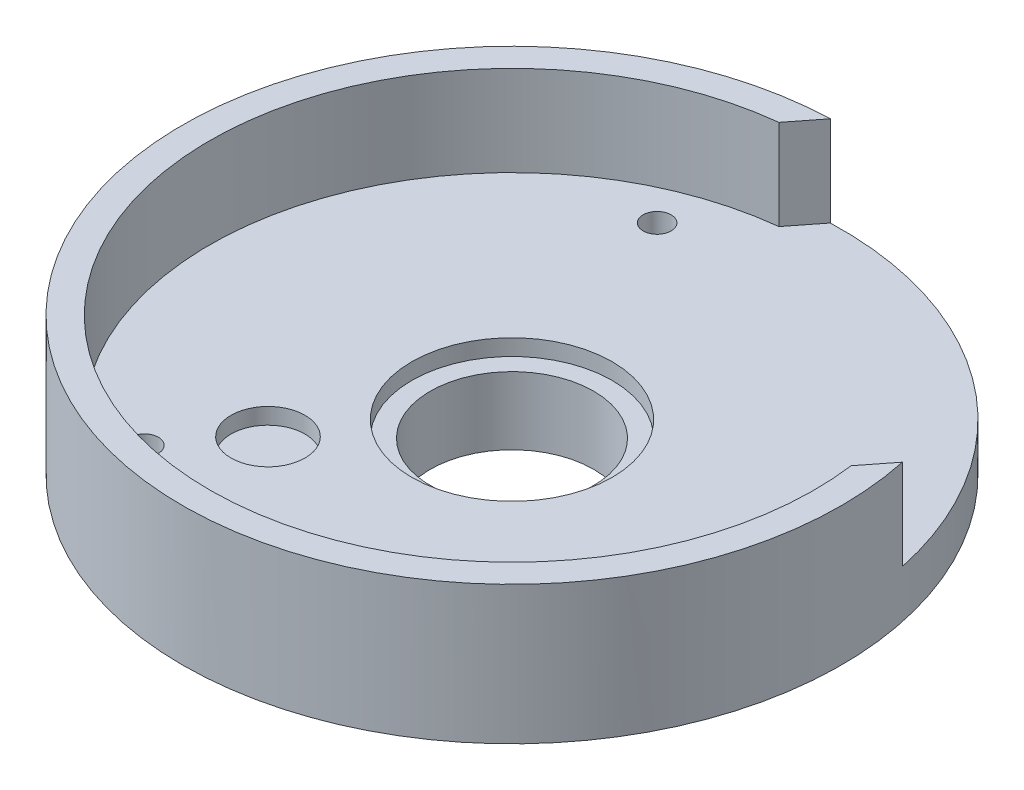
ISO-10303-21;
HEADER;
FILE_DESCRIPTION(('STEP AP214'),'2;1');
FILE_NAME('part.step','',(''),(''),'','','');
FILE_SCHEMA(('AUTOMOTIVE_DESIGN { 1 0 10303 214 1 1 1 1 }'));
ENDSEC;
DATA;
#1=APPLICATION_CONTEXT('core data for automotive mechanical design processes');
#2=APPLICATION_PROTOCOL_DEFINITION('international standard','automotive_design',2000,#1);
#3=PRODUCT_CONTEXT('',#1,'mechanical');
#4=PRODUCT('Part','Part','',(#3));
#5=PRODUCT_RELATED_PRODUCT_CATEGORY('part','',(#4));
#6=PRODUCT_DEFINITION_FORMATION('','',#4);
#7=PRODUCT_DEFINITION_CONTEXT('part definition',#1,'design');
#8=PRODUCT_DEFINITION('design','',#6,#7);
#9=PRODUCT_DEFINITION_SHAPE('','',#8);
#10=(LENGTH_UNIT() NAMED_UNIT(*) SI_UNIT(.MILLI.,.METRE.));
#11=(NAMED_UNIT(*) PLANE_ANGLE_UNIT() SI_UNIT($,.RADIAN.));
#12=(NAMED_UNIT(*) SI_UNIT($,.STERADIAN.) SOLID_ANGLE_UNIT());
#13=UNCERTAINTY_MEASURE_WITH_UNIT(LENGTH_MEASURE(1.E-05),#10,'distance_accuracy_value','');
#14=(GEOMETRIC_REPRESENTATION_CONTEXT(3) GLOBAL_UNCERTAINTY_ASSIGNED_CONTEXT((#13)) GLOBAL_UNIT_ASSIGNED_CONTEXT((#10,
#11,#12)) REPRESENTATION_CONTEXT('',''));
#15=CARTESIAN_POINT('',(0.,0.,0.));
#16=DIRECTION('',(0.,0.,1.));
#17=DIRECTION('',(1.,0.,0.));
#18=AXIS2_PLACEMENT_3D('',#15,#16,#17);
#19=CARTESIAN_POINT('',(0.,5.3,0.));
#20=DIRECTION('',(0.,-1.,0.));
#21=DIRECTION('',(0.,0.,-1.));
#22=AXIS2_PLACEMENT_3D('',#19,#20,#21);
#23=CYLINDRICAL_SURFACE('',#22,11.1);
#24=CARTESIAN_POINT('',(0.,5.3,0.));
#25=DIRECTION('',(0.,1.,0.));
#26=DIRECTION('',(0.,0.,1.));
#27=AXIS2_PLACEMENT_3D('',#24,#25,#26);
#28=CIRCLE('',#27,11.1);
#29=CARTESIAN_POINT('',(0.,5.3,11.1));
#30=VERTEX_POINT('',#29);
#31=EDGE_CURVE('E262',#30,#30,#28,.T.);
#32=ORIENTED_EDGE('',*,*,#31,.T.);
#33=EDGE_LOOP('',(#32));
#34=FACE_BOUND('',#33,.T.);
#35=CARTESIAN_POINT('',(0.,3.5,0.));
#36=DIRECTION('',(0.,-1.,0.));
#37=DIRECTION('',(0.,0.,-1.));
#38=AXIS2_PLACEMENT_3D('',#35,#36,#37);
#39=CIRCLE('',#38,11.1);
#40=CARTESIAN_POINT('',(0.,3.5,-11.1));
#41=VERTEX_POINT('',#40);
#42=EDGE_CURVE('E279',#41,#41,#39,.T.);
#43=ORIENTED_EDGE('',*,*,#42,.T.);
#44=EDGE_LOOP('',(#43));
#45=FACE_BOUND('',#44,.T.);
#46=ADVANCED_FACE('F181',(#34,#45),#23,.F.);
#47=CARTESIAN_POINT('',(0.,5.3,0.));
#48=DIRECTION('',(0.,-1.,0.));
#49=DIRECTION('',(0.,0.,-1.));
#50=AXIS2_PLACEMENT_3D('',#47,#48,#49);
#51=CYLINDRICAL_SURFACE('',#50,36.5);
#52=CARTESIAN_POINT('',(0.,0.,0.));
#53=DIRECTION('',(0.,1.,0.));
#54=DIRECTION('',(0.,0.,1.));
#55=AXIS2_PLACEMENT_3D('',#52,#53,#54);
#56=CIRCLE('',#55,36.5);
#57=CARTESIAN_POINT('',(0.,0.,36.5));
#58=VERTEX_POINT('',#57);
#59=EDGE_CURVE('E251',#58,#58,#56,.T.);
#60=ORIENTED_EDGE('',*,*,#59,.T.);
#61=EDGE_LOOP('',(#60));
#62=FACE_BOUND('',#61,.T.);
#63=DIRECTION('',(0.,-1.,0.));
#64=VECTOR('',#63,1.);
#65=CARTESIAN_POINT('',(35.7128915684139,5.3,-7.53918933458428));
#66=LINE('',#65,#64);
#67=CARTESIAN_POINT('',(35.7128915684139,15.3,-7.53918933458428));
#68=VERTEX_POINT('',#67);
#69=CARTESIAN_POINT('',(35.7128915684139,5.3,-7.53918933458428));
#70=VERTEX_POINT('',#69);
#71=EDGE_CURVE('E254',#68,#70,#66,.T.);
#72=ORIENTED_EDGE('',*,*,#71,.F.);
#73=CARTESIAN_POINT('',(0.,15.3,0.));
#74=DIRECTION('',(0.,1.,0.));
#75=DIRECTION('',(0.,0.,1.));
#76=AXIS2_PLACEMENT_3D('',#73,#74,#75);
#77=CIRCLE('',#76,36.5);
#78=CARTESIAN_POINT('',(-1.22317356805291,15.3,-36.4794989880949));
#79=VERTEX_POINT('',#78);
#80=EDGE_CURVE('E241',#79,#68,#77,.T.);
#81=ORIENTED_EDGE('',*,*,#80,.F.);
#82=DIRECTION('',(0.,-1.,0.));
#83=VECTOR('',#82,1.);
#84=CARTESIAN_POINT('',(-1.22317356805292,5.3,-36.4794989880949));
#85=LINE('',#84,#83);
#86=CARTESIAN_POINT('',(-1.22317356805291,5.3,-36.4794989880949));
#87=VERTEX_POINT('',#86);
#88=EDGE_CURVE('E233',#87,#79,#85,.F.);
#89=ORIENTED_EDGE('',*,*,#88,.F.);
#90=CARTESIAN_POINT('',(0.,5.3,0.));
#91=DIRECTION('',(0.,1.,0.));
#92=DIRECTION('',(0.,0.,1.));
#93=AXIS2_PLACEMENT_3D('',#90,#91,#92);
#94=CIRCLE('',#93,36.5);
#95=EDGE_CURVE('E325',#70,#87,#94,.T.);
#96=ORIENTED_EDGE('',*,*,#95,.F.);
#97=EDGE_LOOP('',(#72,#81,#89,#96));
#98=FACE_BOUND('',#97,.T.);
#99=ADVANCED_FACE('F335',(#62,#98),#51,.T.);
#100=CARTESIAN_POINT('',(0.,15.3,0.));
#101=DIRECTION('',(0.,1.,0.));
#102=DIRECTION('',(0.,0.,1.));
#103=AXIS2_PLACEMENT_3D('',#100,#101,#102);
#104=PLANE('',#103);
#105=ORIENTED_EDGE('',*,*,#80,.T.);
#106=DIRECTION('',(0.616755195680631,0.,-0.787155021962603));
#107=VECTOR('',#106,1.);
#108=CARTESIAN_POINT('',(18.4680325682331,15.3,14.4701548267553));
#109=LINE('',#108,#107);
#110=CARTESIAN_POINT('',(33.2160459240148,15.3,-4.3525042416679));
#111=VERTEX_POINT('',#110);
#112=EDGE_CURVE('E207',#111,#68,#109,.T.);
#113=ORIENTED_EDGE('',*,*,#112,.F.);
#114=CARTESIAN_POINT('',(0.,15.3,0.));
#115=DIRECTION('',(0.,1.,0.));
#116=DIRECTION('',(1.,0.,0.));
#117=AXIS2_PLACEMENT_3D('',#114,#115,#116);
#118=CIRCLE('',#117,33.5);
#119=CARTESIAN_POINT('',(-3.720019212452,15.3,-33.2928138951785));
#120=VERTEX_POINT('',#119);
#121=EDGE_CURVE('E239',#120,#111,#118,.T.);
#122=ORIENTED_EDGE('',*,*,#121,.F.);
#123=DIRECTION('',(-0.616755195680623,0.,0.78715502196261));
#124=VECTOR('',#123,1.);
#125=CARTESIAN_POINT('',(-18.4680325682334,15.3,-14.4701548267553));
#126=LINE('',#125,#124);
#127=EDGE_CURVE('E199',#79,#120,#126,.T.);
#128=ORIENTED_EDGE('',*,*,#127,.F.);
#129=EDGE_LOOP('',(#105,#113,#122,#128));
#130=FACE_BOUND('',#129,.T.);
#131=ADVANCED_FACE('F238',(#130),#104,.T.);
#132=CARTESIAN_POINT('',(0.,15.3,0.));
#133=DIRECTION('',(0.,-1.,0.));
#134=DIRECTION('',(0.,0.,-1.));
#135=AXIS2_PLACEMENT_3D('',#132,#133,#134);
#136=CYLINDRICAL_SURFACE('',#135,33.5);
#137=ORIENTED_EDGE('',*,*,#121,.T.);
#138=DIRECTION('',(0.,-1.,0.));
#139=VECTOR('',#138,1.);
#140=CARTESIAN_POINT('',(33.2160459240148,15.3,-4.3525042416679));
#141=LINE('',#140,#139);
#142=CARTESIAN_POINT('',(33.2160459240148,5.3,-4.3525042416679));
#143=VERTEX_POINT('',#142);
#144=EDGE_CURVE('E224',#111,#143,#141,.T.);
#145=ORIENTED_EDGE('',*,*,#144,.T.);
#146=CARTESIAN_POINT('',(0.,5.3,0.));
#147=DIRECTION('',(0.,1.,0.));
#148=DIRECTION('',(0.,0.,1.));
#149=AXIS2_PLACEMENT_3D('',#146,#147,#148);
#150=CIRCLE('',#149,33.5);
#151=CARTESIAN_POINT('',(-3.72001921245199,5.3,-33.2928138951785));
#152=VERTEX_POINT('',#151);
#153=EDGE_CURVE('E266',#143,#152,#150,.F.);
#154=ORIENTED_EDGE('',*,*,#153,.T.);
#155=DIRECTION('',(0.,-1.,0.));
#156=VECTOR('',#155,1.);
#157=CARTESIAN_POINT('',(-3.72001921245199,15.3,-33.2928138951785));
#158=LINE('',#157,#156);
#159=EDGE_CURVE('E245',#120,#152,#158,.T.);
#160=ORIENTED_EDGE('',*,*,#159,.F.);
#161=EDGE_LOOP('',(#137,#145,#154,#160));
#162=FACE_BOUND('',#161,.T.);
#163=ADVANCED_FACE('F244',(#162),#136,.F.);
#164=CARTESIAN_POINT('',(0.,5.3,0.));
#165=DIRECTION('',(0.,1.,0.));
#166=DIRECTION('',(0.,0.,1.));
#167=AXIS2_PLACEMENT_3D('',#164,#165,#166);
#168=PLANE('',#167);
#169=CARTESIAN_POINT('',(-17.8859006747381,5.3,22.8274956369157));
#170=DIRECTION('',(0.,1.,0.));
#171=DIRECTION('',(0.,0.,1.));
#172=AXIS2_PLACEMENT_3D('',#169,#170,#171);
#173=CIRCLE('',#172,1.55);
#174=CARTESIAN_POINT('',(-17.8859006747381,5.3,24.3774956369157));
#175=VERTEX_POINT('',#174);
#176=EDGE_CURVE('E288',#175,#175,#173,.T.);
#177=ORIENTED_EDGE('',*,*,#176,.F.);
#178=EDGE_LOOP('',(#177));
#179=FACE_BOUND('',#178,.T.);
#180=CARTESIAN_POINT('',(28.7121414637164,5.3,4.07589653543085));
#181=DIRECTION('',(0.,1.,0.));
#182=DIRECTION('',(0.,0.,1.));
#183=AXIS2_PLACEMENT_3D('',#180,#181,#182);
#184=CIRCLE('',#183,1.55);
#185=CARTESIAN_POINT('',(28.7121414637164,5.3,5.62589653543085));
#186=VERTEX_POINT('',#185);
#187=EDGE_CURVE('E489',#186,#186,#184,.T.);
#188=ORIENTED_EDGE('',*,*,#187,.F.);
#189=EDGE_LOOP('',(#188));
#190=FACE_BOUND('',#189,.T.);
#191=CARTESIAN_POINT('',(-10.8262407889782,5.3,-26.9033921723463));
#192=DIRECTION('',(0.,1.,0.));
#193=DIRECTION('',(0.,0.,1.));
#194=AXIS2_PLACEMENT_3D('',#191,#192,#193);
#195=CIRCLE('',#194,1.55);
#196=CARTESIAN_POINT('',(-10.8262407889782,5.3,-25.3533921723463));
#197=VERTEX_POINT('',#196);
#198=EDGE_CURVE('E308',#197,#197,#195,.T.);
#199=ORIENTED_EDGE('',*,*,#198,.F.);
#200=EDGE_LOOP('',(#199));
#201=FACE_BOUND('',#200,.T.);
#202=DIRECTION('',(-0.616755195680623,0.,0.78715502196261));
#203=VECTOR('',#202,1.);
#204=CARTESIAN_POINT('',(-18.4680325682334,5.3,-14.4701548267553));
#205=LINE('',#204,#203);
#206=EDGE_CURVE('E318',#87,#152,#205,.T.);
#207=ORIENTED_EDGE('',*,*,#206,.T.);
#208=ORIENTED_EDGE('',*,*,#153,.F.);
#209=DIRECTION('',(0.616755195680631,0.,-0.787155021962603));
#210=VECTOR('',#209,1.);
#211=CARTESIAN_POINT('',(18.4680325682331,5.3,14.4701548267553));
#212=LINE('',#211,#210);
#213=EDGE_CURVE('E227',#143,#70,#212,.T.);
#214=ORIENTED_EDGE('',*,*,#213,.T.);
#215=ORIENTED_EDGE('',*,*,#95,.T.);
#216=EDGE_LOOP('',(#207,#208,#214,#215));
#217=FACE_BOUND('',#216,.T.);
#218=ORIENTED_EDGE('',*,*,#31,.F.);
#219=EDGE_LOOP('',(#218));
#220=FACE_BOUND('',#219,.T.);
#221=CARTESIAN_POINT('',(-11.872537516852,5.3,15.1527341727802));
#222=DIRECTION('',(0.,1.,0.));
#223=DIRECTION('',(0.,0.,1.));
#224=AXIS2_PLACEMENT_3D('',#221,#222,#223);
#225=CIRCLE('',#224,4.1);
#226=CARTESIAN_POINT('',(-11.872537516852,5.3,19.2527341727802));
#227=VERTEX_POINT('',#226);
#228=EDGE_CURVE('E258',#227,#227,#225,.T.);
#229=ORIENTED_EDGE('',*,*,#228,.F.);
#230=EDGE_LOOP('',(#229));
#231=FACE_BOUND('',#230,.T.);
#232=ADVANCED_FACE('F331',(#179,#190,#201,#217,#220,#231),#168,.T.);
#233=CARTESIAN_POINT('',(-11.872537516852,5.3,15.1527341727802));
#234=DIRECTION('',(0.,-1.,0.));
#235=DIRECTION('',(0.,0.,-1.));
#236=AXIS2_PLACEMENT_3D('',#233,#234,#235);
#237=CYLINDRICAL_SURFACE('',#236,4.1);
#238=CARTESIAN_POINT('',(-11.872537516852,3.5,15.1527341727802));
#239=DIRECTION('',(0.,1.,0.));
#240=DIRECTION('',(0.,0.,1.));
#241=AXIS2_PLACEMENT_3D('',#238,#239,#240);
#242=CIRCLE('',#241,4.1);
#243=CARTESIAN_POINT('',(-11.872537516852,3.5,19.2527341727802));
#244=VERTEX_POINT('',#243);
#245=EDGE_CURVE('E272',#244,#244,#242,.T.);
#246=ORIENTED_EDGE('',*,*,#245,.F.);
#247=EDGE_LOOP('',(#246));
#248=FACE_BOUND('',#247,.T.);
#249=ORIENTED_EDGE('',*,*,#228,.T.);
#250=EDGE_LOOP('',(#249));
#251=FACE_BOUND('',#250,.T.);
#252=ADVANCED_FACE('F183',(#248,#251),#237,.F.);
#253=CARTESIAN_POINT('',(0.,0.,0.));
#254=DIRECTION('',(0.,1.,0.));
#255=DIRECTION('',(0.,0.,1.));
#256=AXIS2_PLACEMENT_3D('',#253,#254,#255);
#257=PLANE('',#256);
#258=CARTESIAN_POINT('',(-17.8859006747381,0.,22.8274956369157));
#259=DIRECTION('',(0.,1.,0.));
#260=DIRECTION('',(0.,0.,1.));
#261=AXIS2_PLACEMENT_3D('',#258,#259,#260);
#262=CIRCLE('',#261,1.55);
#263=CARTESIAN_POINT('',(-17.8859006747381,0.,24.3774956369157));
#264=VERTEX_POINT('',#263);
#265=EDGE_CURVE('E185',#264,#264,#262,.T.);
#266=ORIENTED_EDGE('',*,*,#265,.T.);
#267=EDGE_LOOP('',(#266));
#268=FACE_BOUND('',#267,.T.);
#269=CARTESIAN_POINT('',(28.7121414637164,0.,4.07589653543085));
#270=DIRECTION('',(0.,1.,0.));
#271=DIRECTION('',(0.,0.,1.));
#272=AXIS2_PLACEMENT_3D('',#269,#270,#271);
#273=CIRCLE('',#272,1.55);
#274=CARTESIAN_POINT('',(28.7121414637164,0.,5.62589653543085));
#275=VERTEX_POINT('',#274);
#276=EDGE_CURVE('E287',#275,#275,#273,.T.);
#277=ORIENTED_EDGE('',*,*,#276,.T.);
#278=EDGE_LOOP('',(#277));
#279=FACE_BOUND('',#278,.T.);
#280=CARTESIAN_POINT('',(-10.8262407889782,0.,-26.9033921723463));
#281=DIRECTION('',(0.,1.,0.));
#282=DIRECTION('',(0.,0.,1.));
#283=AXIS2_PLACEMENT_3D('',#280,#281,#282);
#284=CIRCLE('',#283,1.55);
#285=CARTESIAN_POINT('',(-10.8262407889782,0.,-25.3533921723463));
#286=VERTEX_POINT('',#285);
#287=EDGE_CURVE('E284',#286,#286,#284,.T.);
#288=ORIENTED_EDGE('',*,*,#287,.T.);
#289=EDGE_LOOP('',(#288));
#290=FACE_BOUND('',#289,.T.);
#291=CARTESIAN_POINT('',(0.,0.,0.));
#292=DIRECTION('',(0.,1.,0.));
#293=DIRECTION('',(0.,0.,1.));
#294=AXIS2_PLACEMENT_3D('',#291,#292,#293);
#295=CIRCLE('',#294,11.);
#296=CARTESIAN_POINT('',(0.,0.,11.));
#297=VERTEX_POINT('',#296);
#298=EDGE_CURVE('E12',#297,#297,#295,.F.);
#299=ORIENTED_EDGE('',*,*,#298,.F.);
#300=EDGE_LOOP('',(#299));
#301=FACE_BOUND('',#300,.T.);
#302=CARTESIAN_POINT('',(-11.872537516852,0.,15.1527341727802));
#303=DIRECTION('',(0.,1.,0.));
#304=DIRECTION('',(0.,0.,1.));
#305=AXIS2_PLACEMENT_3D('',#302,#303,#304);
#306=CIRCLE('',#305,4.1);
#307=CARTESIAN_POINT('',(-11.872537516852,0.,19.2527341727802));
#308=VERTEX_POINT('',#307);
#309=EDGE_CURVE('E191',#308,#308,#306,.F.);
#310=ORIENTED_EDGE('',*,*,#309,.F.);
#311=EDGE_LOOP('',(#310));
#312=FACE_BOUND('',#311,.T.);
#313=ORIENTED_EDGE('',*,*,#59,.F.);
#314=EDGE_LOOP('',(#313));
#315=FACE_BOUND('',#314,.T.);
#316=ADVANCED_FACE('F358',(#268,#279,#290,#301,#312,#315),#257,.F.);
#317=CARTESIAN_POINT('',(-11.872537516852,3.5,15.1527341727802));
#318=DIRECTION('',(0.,1.,0.));
#319=DIRECTION('',(0.,0.,1.));
#320=AXIS2_PLACEMENT_3D('',#317,#318,#319);
#321=PLANE('',#320);
#322=ORIENTED_EDGE('',*,*,#245,.T.);
#323=EDGE_LOOP('',(#322));
#324=FACE_BOUND('',#323,.T.);
#325=ADVANCED_FACE('F361',(#324),#321,.T.);
#326=CARTESIAN_POINT('',(-11.872537516852,-5.,15.1527341727802));
#327=DIRECTION('',(0.,1.,0.));
#328=DIRECTION('',(0.,0.,1.));
#329=AXIS2_PLACEMENT_3D('',#326,#327,#328);
#330=CYLINDRICAL_SURFACE('',#329,4.1);
#331=CARTESIAN_POINT('',(-11.872537516852,-5.,15.1527341727802));
#332=DIRECTION('',(0.,-1.,0.));
#333=DIRECTION('',(0.,0.,-1.));
#334=AXIS2_PLACEMENT_3D('',#331,#332,#333);
#335=CIRCLE('',#334,4.1);
#336=CARTESIAN_POINT('',(-11.872537516852,-5.,11.0527341727802));
#337=VERTEX_POINT('',#336);
#338=EDGE_CURVE('E247',#337,#337,#335,.T.);
#339=ORIENTED_EDGE('',*,*,#338,.F.);
#340=EDGE_LOOP('',(#339));
#341=FACE_BOUND('',#340,.T.);
#342=ORIENTED_EDGE('',*,*,#309,.T.);
#343=EDGE_LOOP('',(#342));
#344=FACE_BOUND('',#343,.T.);
#345=ADVANCED_FACE('F371',(#341,#344),#330,.T.);
#346=CARTESIAN_POINT('',(-11.872537516852,-5.,15.1527341727802));
#347=DIRECTION('',(0.,-1.,0.));
#348=DIRECTION('',(0.,0.,-1.));
#349=AXIS2_PLACEMENT_3D('',#346,#347,#348);
#350=PLANE('',#349);
#351=ORIENTED_EDGE('',*,*,#338,.T.);
#352=EDGE_LOOP('',(#351));
#353=FACE_BOUND('',#352,.T.);
#354=ADVANCED_FACE('F346',(#353),#350,.T.);
#355=CARTESIAN_POINT('',(18.4680325682331,15.3,14.4701548267553));
#356=DIRECTION('',(-0.787155021962603,0.,-0.616755195680631));
#357=DIRECTION('',(-0.616755195680631,0.,0.787155021962603));
#358=AXIS2_PLACEMENT_3D('',#355,#356,#357);
#359=PLANE('',#358);
#360=ORIENTED_EDGE('',*,*,#71,.T.);
#361=ORIENTED_EDGE('',*,*,#213,.F.);
#362=ORIENTED_EDGE('',*,*,#144,.F.);
#363=ORIENTED_EDGE('',*,*,#112,.T.);
#364=EDGE_LOOP('',(#360,#361,#362,#363));
#365=FACE_BOUND('',#364,.T.);
#366=ADVANCED_FACE('F225',(#365),#359,.T.);
#367=CARTESIAN_POINT('',(-18.4680325682334,15.3,-14.4701548267553));
#368=DIRECTION('',(0.78715502196261,0.,0.616755195680623));
#369=DIRECTION('',(0.616755195680623,0.,-0.78715502196261));
#370=AXIS2_PLACEMENT_3D('',#367,#368,#369);
#371=PLANE('',#370);
#372=ORIENTED_EDGE('',*,*,#88,.T.);
#373=ORIENTED_EDGE('',*,*,#127,.T.);
#374=ORIENTED_EDGE('',*,*,#159,.T.);
#375=ORIENTED_EDGE('',*,*,#206,.F.);
#376=EDGE_LOOP('',(#372,#373,#374,#375));
#377=FACE_BOUND('',#376,.T.);
#378=ADVANCED_FACE('F336',(#377),#371,.T.);
#379=CARTESIAN_POINT('',(0.,3.5,0.));
#380=DIRECTION('',(0.,-1.,0.));
#381=DIRECTION('',(0.,0.,-1.));
#382=AXIS2_PLACEMENT_3D('',#379,#380,#381);
#383=PLANE('',#382);
#384=CARTESIAN_POINT('',(0.,3.5,0.));
#385=DIRECTION('',(0.,-1.,0.));
#386=DIRECTION('',(0.,0.,-1.));
#387=AXIS2_PLACEMENT_3D('',#384,#385,#386);
#388=CIRCLE('',#387,9.05);
#389=CARTESIAN_POINT('',(0.,3.5,-9.05));
#390=VERTEX_POINT('',#389);
#391=EDGE_CURVE('E295',#390,#390,#388,.T.);
#392=ORIENTED_EDGE('',*,*,#391,.T.);
#393=EDGE_LOOP('',(#392));
#394=FACE_BOUND('',#393,.T.);
#395=ORIENTED_EDGE('',*,*,#42,.F.);
#396=EDGE_LOOP('',(#395));
#397=FACE_BOUND('',#396,.T.);
#398=ADVANCED_FACE('F338',(#394,#397),#383,.F.);
#399=CARTESIAN_POINT('',(0.,-4.,0.));
#400=DIRECTION('',(0.,-1.,0.));
#401=DIRECTION('',(0.,0.,-1.));
#402=AXIS2_PLACEMENT_3D('',#399,#400,#401);
#403=PLANE('',#402);
#404=CARTESIAN_POINT('',(0.,-4.,0.));
#405=DIRECTION('',(0.,-1.,0.));
#406=DIRECTION('',(0.,0.,-1.));
#407=AXIS2_PLACEMENT_3D('',#404,#405,#406);
#408=CIRCLE('',#407,11.);
#409=CARTESIAN_POINT('',(0.,-4.,-11.));
#410=VERTEX_POINT('',#409);
#411=EDGE_CURVE('E282',#410,#410,#408,.T.);
#412=ORIENTED_EDGE('',*,*,#411,.T.);
#413=EDGE_LOOP('',(#412));
#414=FACE_BOUND('',#413,.T.);
#415=CARTESIAN_POINT('',(0.,-4.,0.));
#416=DIRECTION('',(0.,-1.,0.));
#417=DIRECTION('',(0.,0.,-1.));
#418=AXIS2_PLACEMENT_3D('',#415,#416,#417);
#419=CIRCLE('',#418,9.05);
#420=CARTESIAN_POINT('',(0.,-4.,-9.05));
#421=VERTEX_POINT('',#420);
#422=EDGE_CURVE('E300',#421,#421,#419,.T.);
#423=ORIENTED_EDGE('',*,*,#422,.F.);
#424=EDGE_LOOP('',(#423));
#425=FACE_BOUND('',#424,.T.);
#426=ADVANCED_FACE('F344',(#414,#425),#403,.T.);
#427=CARTESIAN_POINT('',(0.,-4.,0.));
#428=DIRECTION('',(0.,1.,0.));
#429=DIRECTION('',(0.,0.,1.));
#430=AXIS2_PLACEMENT_3D('',#427,#428,#429);
#431=CYLINDRICAL_SURFACE('',#430,11.);
#432=ORIENTED_EDGE('',*,*,#411,.F.);
#433=EDGE_LOOP('',(#432));
#434=FACE_BOUND('',#433,.T.);
#435=ORIENTED_EDGE('',*,*,#298,.T.);
#436=EDGE_LOOP('',(#435));
#437=FACE_BOUND('',#436,.T.);
#438=ADVANCED_FACE('F416',(#434,#437),#431,.T.);
#439=CARTESIAN_POINT('',(0.,-4.,0.));
#440=DIRECTION('',(0.,1.,0.));
#441=DIRECTION('',(0.,0.,1.));
#442=AXIS2_PLACEMENT_3D('',#439,#440,#441);
#443=CYLINDRICAL_SURFACE('',#442,9.05);
#444=ORIENTED_EDGE('',*,*,#422,.T.);
#445=EDGE_LOOP('',(#444));
#446=FACE_BOUND('',#445,.T.);
#447=ORIENTED_EDGE('',*,*,#391,.F.);
#448=EDGE_LOOP('',(#447));
#449=FACE_BOUND('',#448,.T.);
#450=ADVANCED_FACE('F427',(#446,#449),#443,.F.);
#451=CARTESIAN_POINT('',(-10.8262407889782,-5.,-26.9033921723463));
#452=DIRECTION('',(0.,1.,0.));
#453=DIRECTION('',(0.,0.,1.));
#454=AXIS2_PLACEMENT_3D('',#451,#452,#453);
#455=CYLINDRICAL_SURFACE('',#454,1.55);
#456=CARTESIAN_POINT('',(-10.8262407889782,5.3,-25.3533921723463));
#457=CARTESIAN_POINT('',(-10.8262407889782,5.24479166666667,-25.3533921723463));
#458=CARTESIAN_POINT('',(-10.8262407889782,5.18958333333333,-25.3533921723463));
#459=CARTESIAN_POINT('',(-10.8262407889782,5.07916666666667,-25.3533921723463));
#460=CARTESIAN_POINT('',(-10.8262407889782,5.02395833333333,-25.3533921723463));
#461=CARTESIAN_POINT('',(-10.8262407889782,4.91354166666667,-25.3533921723463));
#462=CARTESIAN_POINT('',(-10.8262407889782,4.85833333333333,-25.3533921723463));
#463=CARTESIAN_POINT('',(-10.8262407889782,4.74791666666666,-25.3533921723463));
#464=CARTESIAN_POINT('',(-10.8262407889782,4.69270833333333,-25.3533921723463));
#465=CARTESIAN_POINT('',(-10.8262407889782,4.58229166666666,-25.3533921723463));
#466=CARTESIAN_POINT('',(-10.8262407889782,4.52708333333333,-25.3533921723463));
#467=CARTESIAN_POINT('',(-10.8262407889782,4.41666666666667,-25.3533921723463));
#468=CARTESIAN_POINT('',(-10.8262407889782,4.36145833333333,-25.3533921723463));
#469=CARTESIAN_POINT('',(-10.8262407889782,4.25104166666666,-25.3533921723463));
#470=CARTESIAN_POINT('',(-10.8262407889782,4.19583333333333,-25.3533921723463));
#471=CARTESIAN_POINT('',(-10.8262407889782,4.08541666666666,-25.3533921723463));
#472=CARTESIAN_POINT('',(-10.8262407889782,4.03020833333333,-25.3533921723463));
#473=CARTESIAN_POINT('',(-10.8262407889782,3.91979166666667,-25.3533921723463));
#474=CARTESIAN_POINT('',(-10.8262407889782,3.86458333333333,-25.3533921723463));
#475=CARTESIAN_POINT('',(-10.8262407889782,3.75416666666667,-25.3533921723463));
#476=CARTESIAN_POINT('',(-10.8262407889782,3.69895833333333,-25.3533921723463));
#477=CARTESIAN_POINT('',(-10.8262407889782,3.58854166666666,-25.3533921723463));
#478=CARTESIAN_POINT('',(-10.8262407889782,3.53333333333333,-25.3533921723463));
#479=CARTESIAN_POINT('',(-10.8262407889782,3.42291666666666,-25.3533921723463));
#480=CARTESIAN_POINT('',(-10.8262407889782,3.36770833333333,-25.3533921723463));
#481=CARTESIAN_POINT('',(-10.8262407889782,3.25729166666667,-25.3533921723463));
#482=CARTESIAN_POINT('',(-10.8262407889782,3.20208333333333,-25.3533921723463));
#483=CARTESIAN_POINT('',(-10.8262407889782,3.09166666666667,-25.3533921723463));
#484=CARTESIAN_POINT('',(-10.8262407889782,3.03645833333333,-25.3533921723463));
#485=CARTESIAN_POINT('',(-10.8262407889782,2.92604166666667,-25.3533921723463));
#486=CARTESIAN_POINT('',(-10.8262407889782,2.87083333333333,-25.3533921723463));
#487=CARTESIAN_POINT('',(-10.8262407889782,2.76041666666666,-25.3533921723463));
#488=CARTESIAN_POINT('',(-10.8262407889782,2.70520833333333,-25.3533921723463));
#489=CARTESIAN_POINT('',(-10.8262407889782,2.59479166666667,-25.3533921723463));
#490=CARTESIAN_POINT('',(-10.8262407889782,2.53958333333333,-25.3533921723463));
#491=CARTESIAN_POINT('',(-10.8262407889782,2.42916666666667,-25.3533921723463));
#492=CARTESIAN_POINT('',(-10.8262407889782,2.37395833333333,-25.3533921723463));
#493=CARTESIAN_POINT('',(-10.8262407889782,2.26354166666667,-25.3533921723463));
#494=CARTESIAN_POINT('',(-10.8262407889782,2.20833333333333,-25.3533921723463));
#495=CARTESIAN_POINT('',(-10.8262407889782,2.09791666666667,-25.3533921723463));
#496=CARTESIAN_POINT('',(-10.8262407889782,2.04270833333333,-25.3533921723463));
#497=CARTESIAN_POINT('',(-10.8262407889782,1.93229166666667,-25.3533921723463));
#498=CARTESIAN_POINT('',(-10.8262407889782,1.87708333333333,-25.3533921723463));
#499=CARTESIAN_POINT('',(-10.8262407889782,1.76666666666667,-25.3533921723463));
#500=CARTESIAN_POINT('',(-10.8262407889782,1.71145833333333,-25.3533921723463));
#501=CARTESIAN_POINT('',(-10.8262407889782,1.60104166666667,-25.3533921723463));
#502=CARTESIAN_POINT('',(-10.8262407889782,1.54583333333333,-25.3533921723463));
#503=CARTESIAN_POINT('',(-10.8262407889782,1.43541666666667,-25.3533921723463));
#504=CARTESIAN_POINT('',(-10.8262407889782,1.38020833333333,-25.3533921723463));
#505=CARTESIAN_POINT('',(-10.8262407889782,1.26979166666667,-25.3533921723463));
#506=CARTESIAN_POINT('',(-10.8262407889782,1.21458333333333,-25.3533921723463));
#507=CARTESIAN_POINT('',(-10.8262407889782,1.10416666666667,-25.3533921723463));
#508=CARTESIAN_POINT('',(-10.8262407889782,1.04895833333333,-25.3533921723463));
#509=CARTESIAN_POINT('',(-10.8262407889782,0.938541666666666,-25.3533921723463));
#510=CARTESIAN_POINT('',(-10.8262407889782,0.883333333333333,-25.3533921723463));
#511=CARTESIAN_POINT('',(-10.8262407889782,0.772916666666667,-25.3533921723463));
#512=CARTESIAN_POINT('',(-10.8262407889782,0.717708333333333,-25.3533921723463));
#513=CARTESIAN_POINT('',(-10.8262407889782,0.607291666666667,-25.3533921723463));
#514=CARTESIAN_POINT('',(-10.8262407889782,0.552083333333333,-25.3533921723463));
#515=CARTESIAN_POINT('',(-10.8262407889782,0.441666666666667,-25.3533921723463));
#516=CARTESIAN_POINT('',(-10.8262407889782,0.386458333333333,-25.3533921723463));
#517=CARTESIAN_POINT('',(-10.8262407889782,0.276041666666667,-25.3533921723463));
#518=CARTESIAN_POINT('',(-10.8262407889782,0.220833333333333,-25.3533921723463));
#519=CARTESIAN_POINT('',(-10.8262407889782,0.110416666666667,-25.3533921723463));
#520=CARTESIAN_POINT('',(-10.8262407889782,0.0552083333333333,-25.3533921723463));
#521=CARTESIAN_POINT('',(-10.8262407889782,0.,-25.3533921723463));
#522=B_SPLINE_CURVE_WITH_KNOTS('',3,(#456,#457,#458,#459,#460,#461,#462,#463,#464,#465,#466,
#467,#468,#469,#470,#471,#472,#473,#474,#475,#476,#477,#478,#479,#480,#481,#482,#483,#484,#485,
#486,#487,#488,#489,#490,#491,#492,#493,#494,#495,#496,#497,#498,#499,#500,#501,#502,#503,#504,
#505,#506,#507,#508,#509,#510,#511,#512,#513,#514,#515,#516,#517,#518,#519,#520,#521),
.UNSPECIFIED.,.F.,.F.,(4,2,2,2,2,2,2,2,2,2,2,2,2,2,2,2,2,2,2,2,2,2,2,2,2,2,2,2,2,2,2,2,4),(0.,
0.165624999999999,0.33125,0.496875000000001,0.6625,0.828124999999999,0.99375,1.159375,1.325,
1.490625,1.65625,1.821875,1.9875,2.153125,2.31875,2.484375,2.65,2.815625,2.98125,3.146875,
3.3125,3.478125,3.64375,3.809375,3.975,4.140625,4.30625,4.471875,4.6375,4.803125,4.96875,
5.134375,5.3),.UNSPECIFIED.);
#523=EDGE_CURVE('BSEAM442',#197,#286,#522,.T.);
#524=ORIENTED_EDGE('',*,*,#198,.T.);
#525=ORIENTED_EDGE('',*,*,#287,.F.);
#526=ORIENTED_EDGE('',*,*,#523,.T.);
#527=ORIENTED_EDGE('',*,*,#523,.F.);
#528=EDGE_LOOP('',(#524,#526,#525,#527));
#529=FACE_BOUND('',#528,.T.);
#530=ADVANCED_FACE('F442',(#529),#455,.F.);
#531=CARTESIAN_POINT('',(28.7121414637164,-5.,4.07589653543085));
#532=DIRECTION('',(0.,1.,0.));
#533=DIRECTION('',(0.,0.,1.));
#534=AXIS2_PLACEMENT_3D('',#531,#532,#533);
#535=CYLINDRICAL_SURFACE('',#534,1.55);
#536=CARTESIAN_POINT('',(28.7121414637164,5.3,5.62589653543085));
#537=CARTESIAN_POINT('',(28.7121414637164,5.24479166666667,5.62589653543085));
#538=CARTESIAN_POINT('',(28.7121414637164,5.18958333333333,5.62589653543085));
#539=CARTESIAN_POINT('',(28.7121414637164,5.07916666666667,5.62589653543085));
#540=CARTESIAN_POINT('',(28.7121414637164,5.02395833333333,5.62589653543085));
#541=CARTESIAN_POINT('',(28.7121414637164,4.91354166666667,5.62589653543085));
#542=CARTESIAN_POINT('',(28.7121414637164,4.85833333333333,5.62589653543085));
#543=CARTESIAN_POINT('',(28.7121414637164,4.74791666666666,5.62589653543085));
#544=CARTESIAN_POINT('',(28.7121414637164,4.69270833333333,5.62589653543085));
#545=CARTESIAN_POINT('',(28.7121414637164,4.58229166666666,5.62589653543085));
#546=CARTESIAN_POINT('',(28.7121414637164,4.52708333333333,5.62589653543085));
#547=CARTESIAN_POINT('',(28.7121414637164,4.41666666666667,5.62589653543085));
#548=CARTESIAN_POINT('',(28.7121414637164,4.36145833333333,5.62589653543085));
#549=CARTESIAN_POINT('',(28.7121414637164,4.25104166666666,5.62589653543085));
#550=CARTESIAN_POINT('',(28.7121414637164,4.19583333333333,5.62589653543085));
#551=CARTESIAN_POINT('',(28.7121414637164,4.08541666666666,5.62589653543085));
#552=CARTESIAN_POINT('',(28.7121414637164,4.03020833333333,5.62589653543085));
#553=CARTESIAN_POINT('',(28.7121414637164,3.91979166666667,5.62589653543085));
#554=CARTESIAN_POINT('',(28.7121414637164,3.86458333333333,5.62589653543085));
#555=CARTESIAN_POINT('',(28.7121414637164,3.75416666666667,5.62589653543085));
#556=CARTESIAN_POINT('',(28.7121414637164,3.69895833333333,5.62589653543085));
#557=CARTESIAN_POINT('',(28.7121414637164,3.58854166666666,5.62589653543085));
#558=CARTESIAN_POINT('',(28.7121414637164,3.53333333333333,5.62589653543085));
#559=CARTESIAN_POINT('',(28.7121414637164,3.42291666666666,5.62589653543085));
#560=CARTESIAN_POINT('',(28.7121414637164,3.36770833333333,5.62589653543085));
#561=CARTESIAN_POINT('',(28.7121414637164,3.25729166666667,5.62589653543085));
#562=CARTESIAN_POINT('',(28.7121414637164,3.20208333333333,5.62589653543085));
#563=CARTESIAN_POINT('',(28.7121414637164,3.09166666666667,5.62589653543085));
#564=CARTESIAN_POINT('',(28.7121414637164,3.03645833333333,5.62589653543085));
#565=CARTESIAN_POINT('',(28.7121414637164,2.92604166666667,5.62589653543085));
#566=CARTESIAN_POINT('',(28.7121414637164,2.87083333333333,5.62589653543085));
#567=CARTESIAN_POINT('',(28.7121414637164,2.76041666666666,5.62589653543085));
#568=CARTESIAN_POINT('',(28.7121414637164,2.70520833333333,5.62589653543085));
#569=CARTESIAN_POINT('',(28.7121414637164,2.59479166666667,5.62589653543085));
#570=CARTESIAN_POINT('',(28.7121414637164,2.53958333333333,5.62589653543085));
#571=CARTESIAN_POINT('',(28.7121414637164,2.42916666666667,5.62589653543085));
#572=CARTESIAN_POINT('',(28.7121414637164,2.37395833333333,5.62589653543085));
#573=CARTESIAN_POINT('',(28.7121414637164,2.26354166666667,5.62589653543085));
#574=CARTESIAN_POINT('',(28.7121414637164,2.20833333333333,5.62589653543085));
#575=CARTESIAN_POINT('',(28.7121414637164,2.09791666666667,5.62589653543085));
#576=CARTESIAN_POINT('',(28.7121414637164,2.04270833333333,5.62589653543085));
#577=CARTESIAN_POINT('',(28.7121414637164,1.93229166666667,5.62589653543085));
#578=CARTESIAN_POINT('',(28.7121414637164,1.87708333333333,5.62589653543085));
#579=CARTESIAN_POINT('',(28.7121414637164,1.76666666666667,5.62589653543085));
#580=CARTESIAN_POINT('',(28.7121414637164,1.71145833333333,5.62589653543085));
#581=CARTESIAN_POINT('',(28.7121414637164,1.60104166666667,5.62589653543085));
#582=CARTESIAN_POINT('',(28.7121414637164,1.54583333333333,5.62589653543085));
#583=CARTESIAN_POINT('',(28.7121414637164,1.43541666666667,5.62589653543085));
#584=CARTESIAN_POINT('',(28.7121414637164,1.38020833333333,5.62589653543085));
#585=CARTESIAN_POINT('',(28.7121414637164,1.26979166666667,5.62589653543085));
#586=CARTESIAN_POINT('',(28.7121414637164,1.21458333333333,5.62589653543085));
#587=CARTESIAN_POINT('',(28.7121414637164,1.10416666666667,5.62589653543085));
#588=CARTESIAN_POINT('',(28.7121414637164,1.04895833333333,5.62589653543085));
#589=CARTESIAN_POINT('',(28.7121414637164,0.938541666666666,5.62589653543085));
#590=CARTESIAN_POINT('',(28.7121414637164,0.883333333333333,5.62589653543085));
#591=CARTESIAN_POINT('',(28.7121414637164,0.772916666666667,5.62589653543085));
#592=CARTESIAN_POINT('',(28.7121414637164,0.717708333333333,5.62589653543085));
#593=CARTESIAN_POINT('',(28.7121414637164,0.607291666666667,5.62589653543085));
#594=CARTESIAN_POINT('',(28.7121414637164,0.552083333333333,5.62589653543085));
#595=CARTESIAN_POINT('',(28.7121414637164,0.441666666666667,5.62589653543085));
#596=CARTESIAN_POINT('',(28.7121414637164,0.386458333333333,5.62589653543085));
#597=CARTESIAN_POINT('',(28.7121414637164,0.276041666666667,5.62589653543085));
#598=CARTESIAN_POINT('',(28.7121414637164,0.220833333333333,5.62589653543085));
#599=CARTESIAN_POINT('',(28.7121414637164,0.110416666666667,5.62589653543085));
#600=CARTESIAN_POINT('',(28.7121414637164,0.0552083333333333,5.62589653543085));
#601=CARTESIAN_POINT('',(28.7121414637164,0.,5.62589653543085));
#602=B_SPLINE_CURVE_WITH_KNOTS('',3,(#536,#537,#538,#539,#540,#541,#542,#543,#544,#545,#546,
#547,#548,#549,#550,#551,#552,#553,#554,#555,#556,#557,#558,#559,#560,#561,#562,#563,#564,#565,
#566,#567,#568,#569,#570,#571,#572,#573,#574,#575,#576,#577,#578,#579,#580,#581,#582,#583,#584,
#585,#586,#587,#588,#589,#590,#591,#592,#593,#594,#595,#596,#597,#598,#599,#600,#601),
.UNSPECIFIED.,.F.,.F.,(4,2,2,2,2,2,2,2,2,2,2,2,2,2,2,2,2,2,2,2,2,2,2,2,2,2,2,2,2,2,2,2,4),(0.,
0.165624999999999,0.33125,0.496875000000001,0.6625,0.828124999999999,0.99375,1.159375,1.325,
1.490625,1.65625,1.821875,1.9875,2.153125,2.31875,2.484375,2.65,2.815625,2.98125,3.146875,
3.3125,3.478125,3.64375,3.809375,3.975,4.140625,4.30625,4.471875,4.6375,4.803125,4.96875,
5.134375,5.3),.UNSPECIFIED.);
#603=EDGE_CURVE('BSEAM461',#186,#275,#602,.T.);
#604=ORIENTED_EDGE('',*,*,#187,.T.);
#605=ORIENTED_EDGE('',*,*,#276,.F.);
#606=ORIENTED_EDGE('',*,*,#603,.T.);
#607=ORIENTED_EDGE('',*,*,#603,.F.);
#608=EDGE_LOOP('',(#604,#606,#605,#607));
#609=FACE_BOUND('',#608,.T.);
#610=ADVANCED_FACE('F461',(#609),#535,.F.);
#611=CARTESIAN_POINT('',(-17.8859006747381,-5.,22.8274956369157));
#612=DIRECTION('',(0.,1.,0.));
#613=DIRECTION('',(0.,0.,1.));
#614=AXIS2_PLACEMENT_3D('',#611,#612,#613);
#615=CYLINDRICAL_SURFACE('',#614,1.55);
#616=CARTESIAN_POINT('',(-17.8859006747381,5.3,24.3774956369157));
#617=CARTESIAN_POINT('',(-17.8859006747381,5.24479166666667,24.3774956369157));
#618=CARTESIAN_POINT('',(-17.8859006747381,5.18958333333333,24.3774956369157));
#619=CARTESIAN_POINT('',(-17.8859006747381,5.07916666666667,24.3774956369157));
#620=CARTESIAN_POINT('',(-17.8859006747381,5.02395833333333,24.3774956369157));
#621=CARTESIAN_POINT('',(-17.8859006747381,4.91354166666667,24.3774956369157));
#622=CARTESIAN_POINT('',(-17.8859006747381,4.85833333333333,24.3774956369157));
#623=CARTESIAN_POINT('',(-17.8859006747381,4.74791666666666,24.3774956369157));
#624=CARTESIAN_POINT('',(-17.8859006747381,4.69270833333333,24.3774956369157));
#625=CARTESIAN_POINT('',(-17.8859006747381,4.58229166666666,24.3774956369157));
#626=CARTESIAN_POINT('',(-17.8859006747381,4.52708333333333,24.3774956369157));
#627=CARTESIAN_POINT('',(-17.8859006747381,4.41666666666667,24.3774956369157));
#628=CARTESIAN_POINT('',(-17.8859006747381,4.36145833333333,24.3774956369157));
#629=CARTESIAN_POINT('',(-17.8859006747381,4.25104166666666,24.3774956369157));
#630=CARTESIAN_POINT('',(-17.8859006747381,4.19583333333333,24.3774956369157));
#631=CARTESIAN_POINT('',(-17.8859006747381,4.08541666666666,24.3774956369157));
#632=CARTESIAN_POINT('',(-17.8859006747381,4.03020833333333,24.3774956369157));
#633=CARTESIAN_POINT('',(-17.8859006747381,3.91979166666667,24.3774956369157));
#634=CARTESIAN_POINT('',(-17.8859006747381,3.86458333333333,24.3774956369157));
#635=CARTESIAN_POINT('',(-17.8859006747381,3.75416666666667,24.3774956369157));
#636=CARTESIAN_POINT('',(-17.8859006747381,3.69895833333333,24.3774956369157));
#637=CARTESIAN_POINT('',(-17.8859006747381,3.58854166666666,24.3774956369157));
#638=CARTESIAN_POINT('',(-17.8859006747381,3.53333333333333,24.3774956369157));
#639=CARTESIAN_POINT('',(-17.8859006747381,3.42291666666666,24.3774956369157));
#640=CARTESIAN_POINT('',(-17.8859006747381,3.36770833333333,24.3774956369157));
#641=CARTESIAN_POINT('',(-17.8859006747381,3.25729166666667,24.3774956369157));
#642=CARTESIAN_POINT('',(-17.8859006747381,3.20208333333333,24.3774956369157));
#643=CARTESIAN_POINT('',(-17.8859006747381,3.09166666666667,24.3774956369157));
#644=CARTESIAN_POINT('',(-17.8859006747381,3.03645833333333,24.3774956369157));
#645=CARTESIAN_POINT('',(-17.8859006747381,2.92604166666667,24.3774956369157));
#646=CARTESIAN_POINT('',(-17.8859006747381,2.87083333333333,24.3774956369157));
#647=CARTESIAN_POINT('',(-17.8859006747381,2.76041666666666,24.3774956369157));
#648=CARTESIAN_POINT('',(-17.8859006747381,2.70520833333333,24.3774956369157));
#649=CARTESIAN_POINT('',(-17.8859006747381,2.59479166666667,24.3774956369157));
#650=CARTESIAN_POINT('',(-17.8859006747381,2.53958333333333,24.3774956369157));
#651=CARTESIAN_POINT('',(-17.8859006747381,2.42916666666667,24.3774956369157));
#652=CARTESIAN_POINT('',(-17.8859006747381,2.37395833333333,24.3774956369157));
#653=CARTESIAN_POINT('',(-17.8859006747381,2.26354166666667,24.3774956369157));
#654=CARTESIAN_POINT('',(-17.8859006747381,2.20833333333333,24.3774956369157));
#655=CARTESIAN_POINT('',(-17.8859006747381,2.09791666666667,24.3774956369157));
#656=CARTESIAN_POINT('',(-17.8859006747381,2.04270833333333,24.3774956369157));
#657=CARTESIAN_POINT('',(-17.8859006747381,1.93229166666667,24.3774956369157));
#658=CARTESIAN_POINT('',(-17.8859006747381,1.87708333333333,24.3774956369157));
#659=CARTESIAN_POINT('',(-17.8859006747381,1.76666666666667,24.3774956369157));
#660=CARTESIAN_POINT('',(-17.8859006747381,1.71145833333333,24.3774956369157));
#661=CARTESIAN_POINT('',(-17.8859006747381,1.60104166666667,24.3774956369157));
#662=CARTESIAN_POINT('',(-17.8859006747381,1.54583333333333,24.3774956369157));
#663=CARTESIAN_POINT('',(-17.8859006747381,1.43541666666667,24.3774956369157));
#664=CARTESIAN_POINT('',(-17.8859006747381,1.38020833333333,24.3774956369157));
#665=CARTESIAN_POINT('',(-17.8859006747381,1.26979166666667,24.3774956369157));
#666=CARTESIAN_POINT('',(-17.8859006747381,1.21458333333333,24.3774956369157));
#667=CARTESIAN_POINT('',(-17.8859006747381,1.10416666666667,24.3774956369157));
#668=CARTESIAN_POINT('',(-17.8859006747381,1.04895833333333,24.3774956369157));
#669=CARTESIAN_POINT('',(-17.8859006747381,0.938541666666666,24.3774956369157));
#670=CARTESIAN_POINT('',(-17.8859006747381,0.883333333333333,24.3774956369157));
#671=CARTESIAN_POINT('',(-17.8859006747381,0.772916666666667,24.3774956369157));
#672=CARTESIAN_POINT('',(-17.8859006747381,0.717708333333333,24.3774956369157));
#673=CARTESIAN_POINT('',(-17.8859006747381,0.607291666666667,24.3774956369157));
#674=CARTESIAN_POINT('',(-17.8859006747381,0.552083333333333,24.3774956369157));
#675=CARTESIAN_POINT('',(-17.8859006747381,0.441666666666667,24.3774956369157));
#676=CARTESIAN_POINT('',(-17.8859006747381,0.386458333333333,24.3774956369157));
#677=CARTESIAN_POINT('',(-17.8859006747381,0.276041666666667,24.3774956369157));
#678=CARTESIAN_POINT('',(-17.8859006747381,0.220833333333333,24.3774956369157));
#679=CARTESIAN_POINT('',(-17.8859006747381,0.110416666666667,24.3774956369157));
#680=CARTESIAN_POINT('',(-17.8859006747381,0.0552083333333333,24.3774956369157));
#681=CARTESIAN_POINT('',(-17.8859006747381,0.,24.3774956369157));
#682=B_SPLINE_CURVE_WITH_KNOTS('',3,(#616,#617,#618,#619,#620,#621,#622,#623,#624,#625,#626,
#627,#628,#629,#630,#631,#632,#633,#634,#635,#636,#637,#638,#639,#640,#641,#642,#643,#644,#645,
#646,#647,#648,#649,#650,#651,#652,#653,#654,#655,#656,#657,#658,#659,#660,#661,#662,#663,#664,
#665,#666,#667,#668,#669,#670,#671,#672,#673,#674,#675,#676,#677,#678,#679,#680,#681),
.UNSPECIFIED.,.F.,.F.,(4,2,2,2,2,2,2,2,2,2,2,2,2,2,2,2,2,2,2,2,2,2,2,2,2,2,2,2,2,2,2,2,4),(0.,
0.165624999999999,0.33125,0.496875000000001,0.6625,0.828124999999999,0.99375,1.159375,1.325,
1.490625,1.65625,1.821875,1.9875,2.153125,2.31875,2.484375,2.65,2.815625,2.98125,3.146875,
3.3125,3.478125,3.64375,3.809375,3.975,4.140625,4.30625,4.471875,4.6375,4.803125,4.96875,
5.134375,5.3),.UNSPECIFIED.);
#683=EDGE_CURVE('BSEAM471',#175,#264,#682,.T.);
#684=ORIENTED_EDGE('',*,*,#176,.T.);
#685=ORIENTED_EDGE('',*,*,#265,.F.);
#686=ORIENTED_EDGE('',*,*,#683,.T.);
#687=ORIENTED_EDGE('',*,*,#683,.F.);
#688=EDGE_LOOP('',(#684,#686,#685,#687));
#689=FACE_BOUND('',#688,.T.);
#690=ADVANCED_FACE('F471',(#689),#615,.F.);
#691=CLOSED_SHELL('',(#46,#99,#131,#163,#232,#252,#316,#325,#345,#354,#366,#378,#398,#426,#438,
#450,#530,#610,#690));
#692=MANIFOLD_SOLID_BREP('B2',#691);
#693=ADVANCED_BREP_SHAPE_REPRESENTATION('',(#18,#692),#14);
#694=SHAPE_DEFINITION_REPRESENTATION(#9,#693);
ENDSEC;
END-ISO-10303-21;
